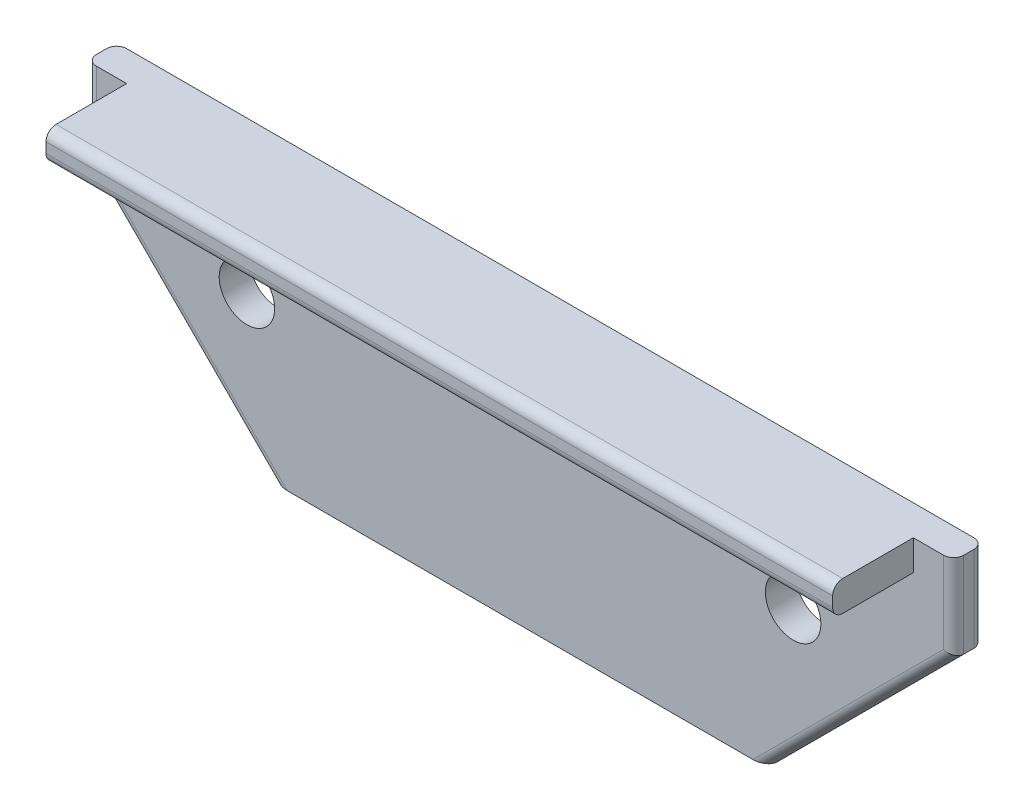
ISO-10303-21;
HEADER;
FILE_DESCRIPTION(('STEP AP214'),'2;1');
FILE_NAME('part.step','',(''),(''),'','','');
FILE_SCHEMA(('AUTOMOTIVE_DESIGN { 1 0 10303 214 1 1 1 1 }'));
ENDSEC;
DATA;
#1=APPLICATION_CONTEXT('core data for automotive mechanical design processes');
#2=APPLICATION_PROTOCOL_DEFINITION('international standard','automotive_design',2000,#1);
#3=PRODUCT_CONTEXT('',#1,'mechanical');
#4=PRODUCT('Part','Part','',(#3));
#5=PRODUCT_RELATED_PRODUCT_CATEGORY('part','',(#4));
#6=PRODUCT_DEFINITION_FORMATION('','',#4);
#7=PRODUCT_DEFINITION_CONTEXT('part definition',#1,'design');
#8=PRODUCT_DEFINITION('design','',#6,#7);
#9=PRODUCT_DEFINITION_SHAPE('','',#8);
#10=(LENGTH_UNIT() NAMED_UNIT(*) SI_UNIT(.MILLI.,.METRE.));
#11=(NAMED_UNIT(*) PLANE_ANGLE_UNIT() SI_UNIT($,.RADIAN.));
#12=(NAMED_UNIT(*) SI_UNIT($,.STERADIAN.) SOLID_ANGLE_UNIT());
#13=UNCERTAINTY_MEASURE_WITH_UNIT(LENGTH_MEASURE(1.E-05),#10,'distance_accuracy_value','');
#14=(GEOMETRIC_REPRESENTATION_CONTEXT(3) GLOBAL_UNCERTAINTY_ASSIGNED_CONTEXT((#13)) GLOBAL_UNIT_ASSIGNED_CONTEXT((#10,
#11,#12)) REPRESENTATION_CONTEXT('',''));
#15=CARTESIAN_POINT('',(0.,0.,0.));
#16=DIRECTION('',(0.,0.,1.));
#17=DIRECTION('',(1.,0.,0.));
#18=AXIS2_PLACEMENT_3D('',#15,#16,#17);
#19=CARTESIAN_POINT('',(0.,0.,-7.9375));
#20=DIRECTION('',(0.,0.,-1.));
#21=DIRECTION('',(-1.,0.,0.));
#22=AXIS2_PLACEMENT_3D('',#19,#20,#21);
#23=PLANE('',#22);
#24=CARTESIAN_POINT('',(85.9789999123034,4.76249999514226,-7.9375));
#25=DIRECTION('',(0.,0.,-1.));
#26=DIRECTION('',(-1.,0.,0.));
#27=AXIS2_PLACEMENT_3D('',#24,#25,#26);
#28=CIRCLE('',#27,8.73124999109411);
#29=CARTESIAN_POINT('',(77.2477499212093,4.76249999514226,-7.9375));
#30=VERTEX_POINT('',#29);
#31=EDGE_CURVE('E232',#30,#30,#28,.T.);
#32=ORIENTED_EDGE('',*,*,#31,.T.);
#33=EDGE_LOOP('',(#32));
#34=FACE_BOUND('',#33,.T.);
#35=CARTESIAN_POINT('',(-85.9789999123005,4.76249999514226,-7.9375));
#36=DIRECTION('',(0.,0.,-1.));
#37=DIRECTION('',(-1.,0.,0.));
#38=AXIS2_PLACEMENT_3D('',#35,#36,#37);
#39=CIRCLE('',#38,8.73124999109411);
#40=CARTESIAN_POINT('',(-94.7102499033946,4.76249999514226,-7.9375));
#41=VERTEX_POINT('',#40);
#42=EDGE_CURVE('E197',#41,#41,#39,.T.);
#43=ORIENTED_EDGE('',*,*,#42,.T.);
#44=EDGE_LOOP('',(#43));
#45=FACE_BOUND('',#44,.T.);
#46=DIRECTION('',(-1.,0.,0.));
#47=VECTOR('',#46,1.);
#48=CARTESIAN_POINT('',(136.524999860745,42.8624999562803,-7.9375));
#49=LINE('',#48,#47);
#50=CARTESIAN_POINT('',(-123.824999873699,42.8624999562803,-7.9375));
#51=VERTEX_POINT('',#50);
#52=CARTESIAN_POINT('',(-133.349999860745,42.8624999562803,-7.9375));
#53=VERTEX_POINT('',#52);
#54=EDGE_CURVE('E188',#51,#53,#49,.T.);
#55=ORIENTED_EDGE('',*,*,#54,.T.);
#56=DIRECTION('',(0.,-1.,0.));
#57=VECTOR('',#56,1.);
#58=CARTESIAN_POINT('',(-133.349999860745,15.8749999838082,-7.9375));
#59=LINE('',#58,#57);
#60=CARTESIAN_POINT('',(-133.349999860745,17.1901280443428,-7.9375));
#61=VERTEX_POINT('',#60);
#62=EDGE_CURVE('E275',#53,#61,#59,.T.);
#63=ORIENTED_EDGE('',*,*,#62,.T.);
#64=DIRECTION('',(0.707106781186556,-0.707106781186539,0.));
#65=VECTOR('',#64,1.);
#66=CARTESIAN_POINT('',(-75.5424358903875,-40.617435926013,-7.9375));
#67=LINE('',#66,#65);
#68=CARTESIAN_POINT('',(-73.2973718601201,-42.8624999562803,-7.9375));
#69=VERTEX_POINT('',#68);
#70=EDGE_CURVE('E273',#61,#69,#67,.T.);
#71=ORIENTED_EDGE('',*,*,#70,.T.);
#72=DIRECTION('',(1.,0.,0.));
#73=VECTOR('',#72,1.);
#74=CARTESIAN_POINT('',(-77.7874999206547,-42.8624999562803,-7.9375));
#75=LINE('',#74,#73);
#76=CARTESIAN_POINT('',(73.2973718601231,-42.8624999562803,-7.9375));
#77=VERTEX_POINT('',#76);
#78=EDGE_CURVE('E187',#69,#77,#75,.T.);
#79=ORIENTED_EDGE('',*,*,#78,.T.);
#80=DIRECTION('',(0.707106781186539,0.707106781186556,0.));
#81=VECTOR('',#80,1.);
#82=CARTESIAN_POINT('',(134.279935830477,18.1200640140755,-7.9375));
#83=LINE('',#82,#81);
#84=CARTESIAN_POINT('',(133.349999860745,17.1901280443428,-7.9375));
#85=VERTEX_POINT('',#84);
#86=EDGE_CURVE('E271',#77,#85,#83,.T.);
#87=ORIENTED_EDGE('',*,*,#86,.T.);
#88=DIRECTION('',(0.,1.,0.));
#89=VECTOR('',#88,1.);
#90=CARTESIAN_POINT('',(133.349999860745,42.8624999562803,-7.9375));
#91=LINE('',#90,#89);
#92=CARTESIAN_POINT('',(133.349999860745,42.8624999562803,-7.9375));
#93=VERTEX_POINT('',#92);
#94=EDGE_CURVE('E186',#85,#93,#91,.T.);
#95=ORIENTED_EDGE('',*,*,#94,.T.);
#96=CARTESIAN_POINT('',(123.824999873699,42.8624999562803,-7.9375));
#97=VERTEX_POINT('',#96);
#98=EDGE_CURVE('E168',#93,#97,#49,.T.);
#99=ORIENTED_EDGE('',*,*,#98,.T.);
#100=DIRECTION('',(0.,1.,0.));
#101=VECTOR('',#100,1.);
#102=CARTESIAN_POINT('',(123.824999873699,42.8624999562803,-7.9375));
#103=LINE('',#102,#101);
#104=CARTESIAN_POINT('',(123.824999873699,33.3374999659958,-7.9375));
#105=VERTEX_POINT('',#104);
#106=EDGE_CURVE('E182',#105,#97,#103,.T.);
#107=ORIENTED_EDGE('',*,*,#106,.F.);
#108=DIRECTION('',(1.,0.,0.));
#109=VECTOR('',#108,1.);
#110=CARTESIAN_POINT('',(123.824999873699,33.3374999659958,-7.9375));
#111=LINE('',#110,#109);
#112=CARTESIAN_POINT('',(-123.824999873699,33.3374999659958,-7.9375));
#113=VERTEX_POINT('',#112);
#114=EDGE_CURVE('E192',#113,#105,#111,.T.);
#115=ORIENTED_EDGE('',*,*,#114,.F.);
#116=DIRECTION('',(0.,-1.,0.));
#117=VECTOR('',#116,1.);
#118=CARTESIAN_POINT('',(-123.824999873699,33.3374999659958,-7.9375));
#119=LINE('',#118,#117);
#120=EDGE_CURVE('E191',#51,#113,#119,.T.);
#121=ORIENTED_EDGE('',*,*,#120,.F.);
#122=EDGE_LOOP('',(#55,#63,#71,#79,#87,#95,#99,#107,#115,#121));
#123=FACE_BOUND('',#122,.T.);
#124=ADVANCED_FACE('F39',(#34,#45,#123),#23,.F.);
#125=CARTESIAN_POINT('',(77.7874999206576,-42.8624999562803,-17.4625));
#126=DIRECTION('',(0.707106781186556,-0.707106781186539,0.));
#127=DIRECTION('',(0.707106781186539,0.707106781186556,0.));
#128=AXIS2_PLACEMENT_3D('',#125,#126,#127);
#129=PLANE('',#128);
#130=DIRECTION('',(0.,0.,1.));
#131=VECTOR('',#130,1.);
#132=CARTESIAN_POINT('',(77.7874999206576,-42.8624999562803,-17.4625));
#133=LINE('',#132,#131);
#134=CARTESIAN_POINT('',(77.7874999206576,-42.8624999562803,-14.2875));
#135=VERTEX_POINT('',#134);
#136=CARTESIAN_POINT('',(77.7874999206576,-42.8624999562803,-11.1125));
#137=VERTEX_POINT('',#136);
#138=EDGE_CURVE('E214',#135,#137,#133,.T.);
#139=ORIENTED_EDGE('',*,*,#138,.F.);
#140=DIRECTION('',(0.707106781186539,0.707106781186556,0.));
#141=VECTOR('',#140,1.);
#142=CARTESIAN_POINT('',(77.7874999206576,-42.8624999562803,-14.2875));
#143=LINE('',#142,#141);
#144=CARTESIAN_POINT('',(136.524999860745,15.8749999838083,-14.2875));
#145=VERTEX_POINT('',#144);
#146=EDGE_CURVE('E285',#135,#145,#143,.T.);
#147=ORIENTED_EDGE('',*,*,#146,.T.);
#148=DIRECTION('',(0.,0.,1.));
#149=VECTOR('',#148,1.);
#150=CARTESIAN_POINT('',(136.524999860745,15.8749999838083,-17.4625));
#151=LINE('',#150,#149);
#152=CARTESIAN_POINT('',(136.524999860745,15.8749999838083,-11.1125));
#153=VERTEX_POINT('',#152);
#154=EDGE_CURVE('E210',#145,#153,#151,.T.);
#155=ORIENTED_EDGE('',*,*,#154,.T.);
#156=DIRECTION('',(0.707106781186539,0.707106781186556,0.));
#157=VECTOR('',#156,1.);
#158=CARTESIAN_POINT('',(77.7874999206576,-42.8624999562803,-11.1125));
#159=LINE('',#158,#157);
#160=EDGE_CURVE('E283',#153,#137,#159,.F.);
#161=ORIENTED_EDGE('',*,*,#160,.T.);
#162=EDGE_LOOP('',(#139,#147,#155,#161));
#163=FACE_BOUND('',#162,.T.);
#164=ADVANCED_FACE('F396',(#163),#129,.T.);
#165=CARTESIAN_POINT('',(-77.7874999206547,-42.8624999562803,-17.4625));
#166=DIRECTION('',(0.,-1.,0.));
#167=DIRECTION('',(0.,0.,-1.));
#168=AXIS2_PLACEMENT_3D('',#165,#166,#167);
#169=PLANE('',#168);
#170=DIRECTION('',(0.,0.,1.));
#171=VECTOR('',#170,1.);
#172=CARTESIAN_POINT('',(-77.7874999206547,-42.8624999562803,-17.4625));
#173=LINE('',#172,#171);
#174=CARTESIAN_POINT('',(-77.7874999206547,-42.8624999562803,-14.2875));
#175=VERTEX_POINT('',#174);
#176=CARTESIAN_POINT('',(-77.7874999206547,-42.8624999562803,-11.1125));
#177=VERTEX_POINT('',#176);
#178=EDGE_CURVE('E218',#175,#177,#173,.T.);
#179=ORIENTED_EDGE('',*,*,#178,.F.);
#180=CARTESIAN_POINT('',(-73.2973718601201,-42.8624999562803,-14.2875));
#181=DIRECTION('',(0.,-1.,0.));
#182=DIRECTION('',(1.,0.,0.));
#183=AXIS2_PLACEMENT_3D('',#180,#181,#182);
#184=ELLIPSE('',#183,4.49012806053463,3.175);
#185=CARTESIAN_POINT('',(-73.2973718601201,-42.8624999562803,-17.4625));
#186=VERTEX_POINT('',#185);
#187=EDGE_CURVE('E247',#175,#186,#184,.T.);
#188=ORIENTED_EDGE('',*,*,#187,.T.);
#189=DIRECTION('',(1.,0.,0.));
#190=VECTOR('',#189,1.);
#191=CARTESIAN_POINT('',(-77.7874999206547,-42.8624999562803,-17.4625));
#192=LINE('',#191,#190);
#193=CARTESIAN_POINT('',(73.2973718601231,-42.8624999562803,-17.4625));
#194=VERTEX_POINT('',#193);
#195=EDGE_CURVE('E208',#186,#194,#192,.T.);
#196=ORIENTED_EDGE('',*,*,#195,.T.);
#197=CARTESIAN_POINT('',(73.2973718601231,-42.8624999562803,-14.2875));
#198=DIRECTION('',(0.,-1.,0.));
#199=DIRECTION('',(1.,0.,0.));
#200=AXIS2_PLACEMENT_3D('',#197,#198,#199);
#201=ELLIPSE('',#200,4.49012806053452,3.175);
#202=EDGE_CURVE('E243',#194,#135,#201,.T.);
#203=ORIENTED_EDGE('',*,*,#202,.T.);
#204=ORIENTED_EDGE('',*,*,#138,.T.);
#205=CARTESIAN_POINT('',(73.2973718601231,-42.8624999562803,-11.1125));
#206=DIRECTION('',(0.,-1.,0.));
#207=DIRECTION('',(-1.,0.,0.));
#208=AXIS2_PLACEMENT_3D('',#205,#206,#207);
#209=ELLIPSE('',#208,4.49012806053452,3.175);
#210=EDGE_CURVE('E241',#137,#77,#209,.T.);
#211=ORIENTED_EDGE('',*,*,#210,.T.);
#212=ORIENTED_EDGE('',*,*,#78,.F.);
#213=CARTESIAN_POINT('',(-73.2973718601201,-42.8624999562803,-11.1125));
#214=DIRECTION('',(0.,-1.,0.));
#215=DIRECTION('',(-1.,0.,0.));
#216=AXIS2_PLACEMENT_3D('',#213,#214,#215);
#217=ELLIPSE('',#216,4.49012806053463,3.175);
#218=EDGE_CURVE('E245',#69,#177,#217,.T.);
#219=ORIENTED_EDGE('',*,*,#218,.T.);
#220=EDGE_LOOP('',(#179,#188,#196,#203,#204,#211,#212,#219));
#221=FACE_BOUND('',#220,.T.);
#222=ADVANCED_FACE('F323',(#221),#169,.T.);
#223=CARTESIAN_POINT('',(-136.524999860745,15.8749999838082,-17.4625));
#224=DIRECTION('',(-0.707106781186539,-0.707106781186556,0.));
#225=DIRECTION('',(0.707106781186556,-0.707106781186539,0.));
#226=AXIS2_PLACEMENT_3D('',#223,#224,#225);
#227=PLANE('',#226);
#228=DIRECTION('',(0.,0.,1.));
#229=VECTOR('',#228,1.);
#230=CARTESIAN_POINT('',(-136.524999860745,15.8749999838082,-17.4625));
#231=LINE('',#230,#229);
#232=CARTESIAN_POINT('',(-136.524999860745,15.8749999838082,-14.2875));
#233=VERTEX_POINT('',#232);
#234=CARTESIAN_POINT('',(-136.524999860745,15.8749999838082,-11.1125));
#235=VERTEX_POINT('',#234);
#236=EDGE_CURVE('E221',#233,#235,#231,.T.);
#237=ORIENTED_EDGE('',*,*,#236,.F.);
#238=DIRECTION('',(0.707106781186556,-0.707106781186539,0.));
#239=VECTOR('',#238,1.);
#240=CARTESIAN_POINT('',(-136.524999860745,15.8749999838082,-14.2875));
#241=LINE('',#240,#239);
#242=EDGE_CURVE('E238',#233,#175,#241,.T.);
#243=ORIENTED_EDGE('',*,*,#242,.T.);
#244=ORIENTED_EDGE('',*,*,#178,.T.);
#245=DIRECTION('',(0.707106781186556,-0.707106781186539,0.));
#246=VECTOR('',#245,1.);
#247=CARTESIAN_POINT('',(-136.524999860745,15.8749999838082,-11.1125));
#248=LINE('',#247,#246);
#249=EDGE_CURVE('E217',#177,#235,#248,.F.);
#250=ORIENTED_EDGE('',*,*,#249,.T.);
#251=EDGE_LOOP('',(#237,#243,#244,#250));
#252=FACE_BOUND('',#251,.T.);
#253=ADVANCED_FACE('F330',(#252),#227,.T.);
#254=CARTESIAN_POINT('',(-136.524999860745,42.8624999562803,-17.4625));
#255=DIRECTION('',(-1.,0.,0.));
#256=DIRECTION('',(0.,0.,1.));
#257=AXIS2_PLACEMENT_3D('',#254,#255,#256);
#258=PLANE('',#257);
#259=DIRECTION('',(0.,0.,1.));
#260=VECTOR('',#259,1.);
#261=CARTESIAN_POINT('',(-136.524999860745,42.8624999562803,-17.4625));
#262=LINE('',#261,#260);
#263=CARTESIAN_POINT('',(-136.524999860745,42.8624999562803,-14.2875));
#264=VERTEX_POINT('',#263);
#265=CARTESIAN_POINT('',(-136.524999860745,42.8624999562803,-11.1125));
#266=VERTEX_POINT('',#265);
#267=EDGE_CURVE('E224',#264,#266,#262,.T.);
#268=ORIENTED_EDGE('',*,*,#267,.F.);
#269=DIRECTION('',(0.,-1.,0.));
#270=VECTOR('',#269,1.);
#271=CARTESIAN_POINT('',(-136.524999860745,42.8624999562803,-14.2875));
#272=LINE('',#271,#270);
#273=EDGE_CURVE('E259',#264,#233,#272,.T.);
#274=ORIENTED_EDGE('',*,*,#273,.T.);
#275=ORIENTED_EDGE('',*,*,#236,.T.);
#276=DIRECTION('',(0.,-1.,0.));
#277=VECTOR('',#276,1.);
#278=CARTESIAN_POINT('',(-136.524999860745,42.8624999562803,-11.1125));
#279=LINE('',#278,#277);
#280=EDGE_CURVE('E257',#235,#266,#279,.F.);
#281=ORIENTED_EDGE('',*,*,#280,.T.);
#282=EDGE_LOOP('',(#268,#274,#275,#281));
#283=FACE_BOUND('',#282,.T.);
#284=ADVANCED_FACE('F335',(#283),#258,.T.);
#285=CARTESIAN_POINT('',(136.524999860745,42.8624999562803,-17.4625));
#286=DIRECTION('',(0.,1.,0.));
#287=DIRECTION('',(0.,0.,1.));
#288=AXIS2_PLACEMENT_3D('',#285,#286,#287);
#289=PLANE('',#288);
#290=DIRECTION('',(-1.,0.,0.));
#291=VECTOR('',#290,1.);
#292=CARTESIAN_POINT('',(136.524999860745,42.8624999562803,-17.4625));
#293=LINE('',#292,#291);
#294=CARTESIAN_POINT('',(133.349999860745,42.8624999562803,-17.4625));
#295=VERTEX_POINT('',#294);
#296=CARTESIAN_POINT('',(-133.349999860745,42.8624999562803,-17.4625));
#297=VERTEX_POINT('',#296);
#298=EDGE_CURVE('E206',#295,#297,#293,.T.);
#299=ORIENTED_EDGE('',*,*,#298,.T.);
#300=CARTESIAN_POINT('',(-133.349999860745,42.8624999562803,-14.2875));
#301=DIRECTION('',(0.,1.,0.));
#302=DIRECTION('',(0.,0.,1.));
#303=AXIS2_PLACEMENT_3D('',#300,#301,#302);
#304=CIRCLE('',#303,3.175);
#305=EDGE_CURVE('E268',#297,#264,#304,.T.);
#306=ORIENTED_EDGE('',*,*,#305,.T.);
#307=ORIENTED_EDGE('',*,*,#267,.T.);
#308=CARTESIAN_POINT('',(-133.349999860745,42.8624999562803,-11.1125));
#309=DIRECTION('',(0.,1.,0.));
#310=DIRECTION('',(0.,0.,1.));
#311=AXIS2_PLACEMENT_3D('',#308,#309,#310);
#312=CIRCLE('',#311,3.175);
#313=EDGE_CURVE('E266',#266,#53,#312,.T.);
#314=ORIENTED_EDGE('',*,*,#313,.T.);
#315=ORIENTED_EDGE('',*,*,#54,.F.);
#316=DIRECTION('',(0.,0.,-1.));
#317=VECTOR('',#316,1.);
#318=CARTESIAN_POINT('',(-123.824999873699,42.8624999562803,17.4625));
#319=LINE('',#318,#317);
#320=CARTESIAN_POINT('',(-123.824999873699,42.8624999562803,14.2875));
#321=VERTEX_POINT('',#320);
#322=EDGE_CURVE('E176',#321,#51,#319,.T.);
#323=ORIENTED_EDGE('',*,*,#322,.F.);
#324=DIRECTION('',(-1.,0.,0.));
#325=VECTOR('',#324,1.);
#326=CARTESIAN_POINT('',(123.824999873699,42.8624999562803,14.2875));
#327=LINE('',#326,#325);
#328=CARTESIAN_POINT('',(123.824999873699,42.8624999562803,14.2875));
#329=VERTEX_POINT('',#328);
#330=EDGE_CURVE('E172',#321,#329,#327,.F.);
#331=ORIENTED_EDGE('',*,*,#330,.T.);
#332=DIRECTION('',(0.,0.,-1.));
#333=VECTOR('',#332,1.);
#334=CARTESIAN_POINT('',(123.824999873699,42.8624999562803,17.4625));
#335=LINE('',#334,#333);
#336=EDGE_CURVE('E164',#329,#97,#335,.T.);
#337=ORIENTED_EDGE('',*,*,#336,.T.);
#338=ORIENTED_EDGE('',*,*,#98,.F.);
#339=CARTESIAN_POINT('',(133.349999860745,42.8624999562803,-11.1125));
#340=DIRECTION('',(0.,1.,0.));
#341=DIRECTION('',(0.,0.,1.));
#342=AXIS2_PLACEMENT_3D('',#339,#340,#341);
#343=CIRCLE('',#342,3.175);
#344=CARTESIAN_POINT('',(136.524999860745,42.8624999562803,-11.1125));
#345=VERTEX_POINT('',#344);
#346=EDGE_CURVE('E261',#93,#345,#343,.T.);
#347=ORIENTED_EDGE('',*,*,#346,.T.);
#348=DIRECTION('',(0.,0.,1.));
#349=VECTOR('',#348,1.);
#350=CARTESIAN_POINT('',(136.524999860745,42.8624999562803,-17.4625));
#351=LINE('',#350,#349);
#352=CARTESIAN_POINT('',(136.524999860745,42.8624999562803,-14.2875));
#353=VERTEX_POINT('',#352);
#354=EDGE_CURVE('E227',#353,#345,#351,.T.);
#355=ORIENTED_EDGE('',*,*,#354,.F.);
#356=CARTESIAN_POINT('',(133.349999860745,42.8624999562803,-14.2875));
#357=DIRECTION('',(0.,1.,0.));
#358=DIRECTION('',(0.,0.,1.));
#359=AXIS2_PLACEMENT_3D('',#356,#357,#358);
#360=CIRCLE('',#359,3.175);
#361=EDGE_CURVE('E264',#353,#295,#360,.T.);
#362=ORIENTED_EDGE('',*,*,#361,.T.);
#363=EDGE_LOOP('',(#299,#306,#307,#314,#315,#323,#331,#337,#338,#347,#355,#362));
#364=FACE_BOUND('',#363,.T.);
#365=ADVANCED_FACE('F167',(#364),#289,.T.);
#366=CARTESIAN_POINT('',(136.524999860745,15.8749999838083,-17.4625));
#367=DIRECTION('',(1.,0.,0.));
#368=DIRECTION('',(0.,0.,-1.));
#369=AXIS2_PLACEMENT_3D('',#366,#367,#368);
#370=PLANE('',#369);
#371=ORIENTED_EDGE('',*,*,#154,.F.);
#372=DIRECTION('',(0.,1.,0.));
#373=VECTOR('',#372,1.);
#374=CARTESIAN_POINT('',(136.524999860745,15.8749999838083,-14.2875));
#375=LINE('',#374,#373);
#376=EDGE_CURVE('E280',#145,#353,#375,.T.);
#377=ORIENTED_EDGE('',*,*,#376,.T.);
#378=ORIENTED_EDGE('',*,*,#354,.T.);
#379=DIRECTION('',(0.,1.,0.));
#380=VECTOR('',#379,1.);
#381=CARTESIAN_POINT('',(136.524999860745,15.8749999838083,-11.1125));
#382=LINE('',#381,#380);
#383=EDGE_CURVE('E278',#345,#153,#382,.F.);
#384=ORIENTED_EDGE('',*,*,#383,.T.);
#385=EDGE_LOOP('',(#371,#377,#378,#384));
#386=FACE_BOUND('',#385,.T.);
#387=ADVANCED_FACE('F371',(#386),#370,.T.);
#388=CARTESIAN_POINT('',(0.,0.,-17.4625));
#389=DIRECTION('',(0.,0.,-1.));
#390=DIRECTION('',(-1.,0.,0.));
#391=AXIS2_PLACEMENT_3D('',#388,#389,#390);
#392=PLANE('',#391);
#393=CARTESIAN_POINT('',(85.9789999123034,4.76249999514226,-17.4625));
#394=DIRECTION('',(0.,0.,-1.));
#395=DIRECTION('',(-1.,0.,0.));
#396=AXIS2_PLACEMENT_3D('',#393,#394,#395);
#397=CIRCLE('',#396,8.73124999109411);
#398=CARTESIAN_POINT('',(77.2477499212093,4.76249999514226,-17.4625));
#399=VERTEX_POINT('',#398);
#400=EDGE_CURVE('E236',#399,#399,#397,.T.);
#401=ORIENTED_EDGE('',*,*,#400,.F.);
#402=EDGE_LOOP('',(#401));
#403=FACE_BOUND('',#402,.T.);
#404=CARTESIAN_POINT('',(-85.9789999123005,4.76249999514226,-17.4625));
#405=DIRECTION('',(0.,0.,-1.));
#406=DIRECTION('',(-1.,0.,0.));
#407=AXIS2_PLACEMENT_3D('',#404,#405,#406);
#408=CIRCLE('',#407,8.73124999109411);
#409=CARTESIAN_POINT('',(-94.7102499033946,4.76249999514226,-17.4625));
#410=VERTEX_POINT('',#409);
#411=EDGE_CURVE('E235',#410,#410,#408,.T.);
#412=ORIENTED_EDGE('',*,*,#411,.F.);
#413=EDGE_LOOP('',(#412));
#414=FACE_BOUND('',#413,.T.);
#415=ORIENTED_EDGE('',*,*,#195,.F.);
#416=DIRECTION('',(0.707106781186556,-0.707106781186539,0.));
#417=VECTOR('',#416,1.);
#418=CARTESIAN_POINT('',(-58.0799359081993,-58.0799359082007,-17.4625));
#419=LINE('',#418,#417);
#420=CARTESIAN_POINT('',(-133.349999860745,17.1901280443428,-17.4625));
#421=VERTEX_POINT('',#420);
#422=EDGE_CURVE('E255',#186,#421,#419,.F.);
#423=ORIENTED_EDGE('',*,*,#422,.T.);
#424=DIRECTION('',(0.,-1.,0.));
#425=VECTOR('',#424,1.);
#426=CARTESIAN_POINT('',(-133.349999860745,0.,-17.4625));
#427=LINE('',#426,#425);
#428=EDGE_CURVE('E253',#421,#297,#427,.F.);
#429=ORIENTED_EDGE('',*,*,#428,.T.);
#430=ORIENTED_EDGE('',*,*,#298,.F.);
#431=DIRECTION('',(0.,1.,0.));
#432=VECTOR('',#431,1.);
#433=CARTESIAN_POINT('',(133.349999860745,0.,-17.4625));
#434=LINE('',#433,#432);
#435=CARTESIAN_POINT('',(133.349999860745,17.1901280443428,-17.4625));
#436=VERTEX_POINT('',#435);
#437=EDGE_CURVE('E251',#295,#436,#434,.F.);
#438=ORIENTED_EDGE('',*,*,#437,.T.);
#439=DIRECTION('',(0.707106781186539,0.707106781186556,0.));
#440=VECTOR('',#439,1.);
#441=CARTESIAN_POINT('',(58.0799359082026,-58.0799359082012,-17.4625));
#442=LINE('',#441,#440);
#443=EDGE_CURVE('E249',#436,#194,#442,.F.);
#444=ORIENTED_EDGE('',*,*,#443,.T.);
#445=EDGE_LOOP('',(#415,#423,#429,#430,#438,#444));
#446=FACE_BOUND('',#445,.T.);
#447=ADVANCED_FACE('F367',(#403,#414,#446),#392,.T.);
#448=CARTESIAN_POINT('',(123.824999873699,33.3374999659958,17.4625));
#449=DIRECTION('',(0.,1.,0.));
#450=DIRECTION('',(0.,0.,1.));
#451=AXIS2_PLACEMENT_3D('',#448,#449,#450);
#452=PLANE('',#451);
#453=DIRECTION('',(0.,0.,-1.));
#454=VECTOR('',#453,1.);
#455=CARTESIAN_POINT('',(123.824999873699,33.3374999659958,17.4625));
#456=LINE('',#455,#454);
#457=CARTESIAN_POINT('',(123.824999873699,33.3374999659958,14.2875));
#458=VERTEX_POINT('',#457);
#459=EDGE_CURVE('E175',#458,#105,#456,.T.);
#460=ORIENTED_EDGE('',*,*,#459,.F.);
#461=DIRECTION('',(1.,0.,0.));
#462=VECTOR('',#461,1.);
#463=CARTESIAN_POINT('',(123.824999873699,33.3374999659958,14.2875));
#464=LINE('',#463,#462);
#465=CARTESIAN_POINT('',(-123.824999873699,33.3374999659958,14.2875));
#466=VERTEX_POINT('',#465);
#467=EDGE_CURVE('E11',#458,#466,#464,.F.);
#468=ORIENTED_EDGE('',*,*,#467,.T.);
#469=DIRECTION('',(0.,0.,-1.));
#470=VECTOR('',#469,1.);
#471=CARTESIAN_POINT('',(-123.824999873699,33.3374999659958,17.4625));
#472=LINE('',#471,#470);
#473=EDGE_CURVE('E201',#466,#113,#472,.T.);
#474=ORIENTED_EDGE('',*,*,#473,.T.);
#475=ORIENTED_EDGE('',*,*,#114,.T.);
#476=EDGE_LOOP('',(#460,#468,#474,#475));
#477=FACE_BOUND('',#476,.T.);
#478=ADVANCED_FACE('F370',(#477),#452,.F.);
#479=CARTESIAN_POINT('',(123.824999873699,42.8624999562803,17.4625));
#480=DIRECTION('',(-1.,0.,0.));
#481=DIRECTION('',(0.,0.,1.));
#482=AXIS2_PLACEMENT_3D('',#479,#480,#481);
#483=PLANE('',#482);
#484=ORIENTED_EDGE('',*,*,#336,.F.);
#485=CARTESIAN_POINT('',(123.824999873699,39.6874999562803,14.2875));
#486=DIRECTION('',(-1.,0.,0.));
#487=DIRECTION('',(0.,0.,1.));
#488=AXIS2_PLACEMENT_3D('',#485,#486,#487);
#489=CIRCLE('',#488,3.175);
#490=CARTESIAN_POINT('',(123.824999873699,39.6874999562803,17.4625));
#491=VERTEX_POINT('',#490);
#492=EDGE_CURVE('E48',#329,#491,#489,.F.);
#493=ORIENTED_EDGE('',*,*,#492,.T.);
#494=DIRECTION('',(0.,1.,0.));
#495=VECTOR('',#494,1.);
#496=CARTESIAN_POINT('',(123.824999873699,42.8624999562803,17.4625));
#497=LINE('',#496,#495);
#498=CARTESIAN_POINT('',(123.824999873699,36.5124999659958,17.4625));
#499=VERTEX_POINT('',#498);
#500=EDGE_CURVE('E195',#499,#491,#497,.T.);
#501=ORIENTED_EDGE('',*,*,#500,.F.);
#502=CARTESIAN_POINT('',(123.824999873699,36.5124999659958,14.2875));
#503=DIRECTION('',(-1.,0.,0.));
#504=DIRECTION('',(0.,0.,1.));
#505=AXIS2_PLACEMENT_3D('',#502,#503,#504);
#506=CIRCLE('',#505,3.175);
#507=EDGE_CURVE('E56',#499,#458,#506,.F.);
#508=ORIENTED_EDGE('',*,*,#507,.T.);
#509=ORIENTED_EDGE('',*,*,#459,.T.);
#510=ORIENTED_EDGE('',*,*,#106,.T.);
#511=EDGE_LOOP('',(#484,#493,#501,#508,#509,#510));
#512=FACE_BOUND('',#511,.T.);
#513=ADVANCED_FACE('F190',(#512),#483,.F.);
#514=CARTESIAN_POINT('',(-123.824999873699,33.3374999659958,17.4625));
#515=DIRECTION('',(1.,0.,0.));
#516=DIRECTION('',(0.,0.,-1.));
#517=AXIS2_PLACEMENT_3D('',#514,#515,#516);
#518=PLANE('',#517);
#519=DIRECTION('',(0.,-1.,0.));
#520=VECTOR('',#519,1.);
#521=CARTESIAN_POINT('',(-123.824999873699,33.3374999659958,17.4625));
#522=LINE('',#521,#520);
#523=CARTESIAN_POINT('',(-123.824999873699,39.6874999562803,17.4625));
#524=VERTEX_POINT('',#523);
#525=CARTESIAN_POINT('',(-123.824999873699,36.5124999659958,17.4625));
#526=VERTEX_POINT('',#525);
#527=EDGE_CURVE('E203',#524,#526,#522,.T.);
#528=ORIENTED_EDGE('',*,*,#527,.F.);
#529=CARTESIAN_POINT('',(-123.824999873699,39.6874999562803,14.2875));
#530=DIRECTION('',(1.,0.,0.));
#531=DIRECTION('',(0.,0.,-1.));
#532=AXIS2_PLACEMENT_3D('',#529,#530,#531);
#533=CIRCLE('',#532,3.175);
#534=EDGE_CURVE('E295',#524,#321,#533,.F.);
#535=ORIENTED_EDGE('',*,*,#534,.T.);
#536=ORIENTED_EDGE('',*,*,#322,.T.);
#537=ORIENTED_EDGE('',*,*,#120,.T.);
#538=ORIENTED_EDGE('',*,*,#473,.F.);
#539=CARTESIAN_POINT('',(-123.824999873699,36.5124999659958,14.2875));
#540=DIRECTION('',(1.,0.,0.));
#541=DIRECTION('',(0.,0.,-1.));
#542=AXIS2_PLACEMENT_3D('',#539,#540,#541);
#543=CIRCLE('',#542,3.175);
#544=EDGE_CURVE('E293',#466,#526,#543,.F.);
#545=ORIENTED_EDGE('',*,*,#544,.T.);
#546=EDGE_LOOP('',(#528,#535,#536,#537,#538,#545));
#547=FACE_BOUND('',#546,.T.);
#548=ADVANCED_FACE('F345',(#547),#518,.F.);
#549=CARTESIAN_POINT('',(0.,0.,17.4625));
#550=DIRECTION('',(0.,0.,-1.));
#551=DIRECTION('',(-1.,0.,0.));
#552=AXIS2_PLACEMENT_3D('',#549,#550,#551);
#553=PLANE('',#552);
#554=ORIENTED_EDGE('',*,*,#500,.T.);
#555=DIRECTION('',(-1.,0.,0.));
#556=VECTOR('',#555,1.);
#557=CARTESIAN_POINT('',(-123.824999873699,39.6874999562803,17.4625));
#558=LINE('',#557,#556);
#559=EDGE_CURVE('E290',#491,#524,#558,.T.);
#560=ORIENTED_EDGE('',*,*,#559,.T.);
#561=ORIENTED_EDGE('',*,*,#527,.T.);
#562=DIRECTION('',(1.,0.,0.));
#563=VECTOR('',#562,1.);
#564=CARTESIAN_POINT('',(0.,36.5124999659958,17.4625));
#565=LINE('',#564,#563);
#566=EDGE_CURVE('E287',#526,#499,#565,.T.);
#567=ORIENTED_EDGE('',*,*,#566,.T.);
#568=EDGE_LOOP('',(#554,#560,#561,#567));
#569=FACE_BOUND('',#568,.T.);
#570=ADVANCED_FACE('F352',(#569),#553,.F.);
#571=CARTESIAN_POINT('',(-85.9789999123005,4.76249999514226,-17.4625));
#572=DIRECTION('',(0.,0.,-1.));
#573=DIRECTION('',(-1.,0.,0.));
#574=AXIS2_PLACEMENT_3D('',#571,#572,#573);
#575=CYLINDRICAL_SURFACE('',#574,8.73124999109411);
#576=ORIENTED_EDGE('',*,*,#411,.T.);
#577=EDGE_LOOP('',(#576));
#578=FACE_BOUND('',#577,.T.);
#579=ORIENTED_EDGE('',*,*,#42,.F.);
#580=EDGE_LOOP('',(#579));
#581=FACE_BOUND('',#580,.T.);
#582=ADVANCED_FACE('F472',(#578,#581),#575,.F.);
#583=CARTESIAN_POINT('',(85.9789999123034,4.76249999514226,-17.4625));
#584=DIRECTION('',(0.,0.,-1.));
#585=DIRECTION('',(-1.,0.,0.));
#586=AXIS2_PLACEMENT_3D('',#583,#584,#585);
#587=CYLINDRICAL_SURFACE('',#586,8.73124999109411);
#588=ORIENTED_EDGE('',*,*,#400,.T.);
#589=EDGE_LOOP('',(#588));
#590=FACE_BOUND('',#589,.T.);
#591=ORIENTED_EDGE('',*,*,#31,.F.);
#592=EDGE_LOOP('',(#591));
#593=FACE_BOUND('',#592,.T.);
#594=ADVANCED_FACE('F364',(#590,#593),#587,.F.);
#595=CARTESIAN_POINT('',(-133.349999860745,42.8624999562803,-14.2875));
#596=DIRECTION('',(0.,-1.,0.));
#597=DIRECTION('',(0.,0.,-1.));
#598=AXIS2_PLACEMENT_3D('',#595,#596,#597);
#599=CYLINDRICAL_SURFACE('',#598,3.175);
#600=ORIENTED_EDGE('',*,*,#305,.F.);
#601=ORIENTED_EDGE('',*,*,#428,.F.);
#602=CARTESIAN_POINT('',(-133.349999860745,17.1901280443428,-14.2875));
#603=DIRECTION('',(0.382683432365096,-0.923879532511284,0.));
#604=DIRECTION('',(-0.923879532511284,-0.382683432365096,0.));
#605=AXIS2_PLACEMENT_3D('',#602,#603,#604);
#606=ELLIPSE('',#605,3.43659523592836,3.175);
#607=EDGE_CURVE('E299',#233,#421,#606,.T.);
#608=ORIENTED_EDGE('',*,*,#607,.F.);
#609=ORIENTED_EDGE('',*,*,#273,.F.);
#610=EDGE_LOOP('',(#600,#601,#608,#609));
#611=FACE_BOUND('',#610,.T.);
#612=ADVANCED_FACE('F385',(#611),#599,.T.);
#613=CARTESIAN_POINT('',(-134.279935830477,18.1200640140756,-14.2875));
#614=DIRECTION('',(0.707106781186556,-0.707106781186539,0.));
#615=DIRECTION('',(0.707106781186539,0.707106781186556,0.));
#616=AXIS2_PLACEMENT_3D('',#613,#614,#615);
#617=CYLINDRICAL_SURFACE('',#616,3.175);
#618=ORIENTED_EDGE('',*,*,#607,.T.);
#619=ORIENTED_EDGE('',*,*,#422,.F.);
#620=ORIENTED_EDGE('',*,*,#187,.F.);
#621=ORIENTED_EDGE('',*,*,#242,.F.);
#622=EDGE_LOOP('',(#618,#619,#620,#621));
#623=FACE_BOUND('',#622,.T.);
#624=ADVANCED_FACE('F381',(#623),#617,.T.);
#625=CARTESIAN_POINT('',(-58.0799359081993,-58.0799359082007,-11.1125));
#626=DIRECTION('',(-0.707106781186556,0.707106781186539,0.));
#627=DIRECTION('',(-0.707106781186539,-0.707106781186556,0.));
#628=AXIS2_PLACEMENT_3D('',#625,#626,#627);
#629=CYLINDRICAL_SURFACE('',#628,3.175);
#630=ORIENTED_EDGE('',*,*,#218,.F.);
#631=ORIENTED_EDGE('',*,*,#70,.F.);
#632=CARTESIAN_POINT('',(-133.349999860745,17.1901280443428,-11.1125));
#633=DIRECTION('',(-0.382683432365096,0.923879532511284,0.));
#634=DIRECTION('',(-0.923879532511284,-0.382683432365096,0.));
#635=AXIS2_PLACEMENT_3D('',#632,#633,#634);
#636=ELLIPSE('',#635,3.43659523592836,3.175);
#637=EDGE_CURVE('E302',#235,#61,#636,.T.);
#638=ORIENTED_EDGE('',*,*,#637,.F.);
#639=ORIENTED_EDGE('',*,*,#249,.F.);
#640=EDGE_LOOP('',(#630,#631,#638,#639));
#641=FACE_BOUND('',#640,.T.);
#642=ADVANCED_FACE('F326',(#641),#629,.T.);
#643=CARTESIAN_POINT('',(-133.349999860745,0.,-11.1125));
#644=DIRECTION('',(0.,1.,0.));
#645=DIRECTION('',(0.,0.,1.));
#646=AXIS2_PLACEMENT_3D('',#643,#644,#645);
#647=CYLINDRICAL_SURFACE('',#646,3.175);
#648=ORIENTED_EDGE('',*,*,#313,.F.);
#649=ORIENTED_EDGE('',*,*,#280,.F.);
#650=ORIENTED_EDGE('',*,*,#637,.T.);
#651=ORIENTED_EDGE('',*,*,#62,.F.);
#652=EDGE_LOOP('',(#648,#649,#650,#651));
#653=FACE_BOUND('',#652,.T.);
#654=ADVANCED_FACE('F339',(#653),#647,.T.);
#655=CARTESIAN_POINT('',(75.5424358903903,-40.6174359260131,-14.2875));
#656=DIRECTION('',(0.707106781186539,0.707106781186556,0.));
#657=DIRECTION('',(-0.707106781186556,0.707106781186539,0.));
#658=AXIS2_PLACEMENT_3D('',#655,#656,#657);
#659=CYLINDRICAL_SURFACE('',#658,3.175);
#660=ORIENTED_EDGE('',*,*,#202,.F.);
#661=ORIENTED_EDGE('',*,*,#443,.F.);
#662=CARTESIAN_POINT('',(133.349999860745,17.1901280443428,-14.2875));
#663=DIRECTION('',(0.382683432365084,0.923879532511289,0.));
#664=DIRECTION('',(0.923879532511289,-0.382683432365084,0.));
#665=AXIS2_PLACEMENT_3D('',#662,#663,#664);
#666=ELLIPSE('',#665,3.43659523592834,3.175);
#667=EDGE_CURVE('E303',#145,#436,#666,.T.);
#668=ORIENTED_EDGE('',*,*,#667,.F.);
#669=ORIENTED_EDGE('',*,*,#146,.F.);
#670=EDGE_LOOP('',(#660,#661,#668,#669));
#671=FACE_BOUND('',#670,.T.);
#672=ADVANCED_FACE('F394',(#671),#659,.T.);
#673=CARTESIAN_POINT('',(133.349999860745,15.8749999838083,-14.2875));
#674=DIRECTION('',(0.,1.,0.));
#675=DIRECTION('',(0.,0.,1.));
#676=AXIS2_PLACEMENT_3D('',#673,#674,#675);
#677=CYLINDRICAL_SURFACE('',#676,3.175);
#678=ORIENTED_EDGE('',*,*,#667,.T.);
#679=ORIENTED_EDGE('',*,*,#437,.F.);
#680=ORIENTED_EDGE('',*,*,#361,.F.);
#681=ORIENTED_EDGE('',*,*,#376,.F.);
#682=EDGE_LOOP('',(#678,#679,#680,#681));
#683=FACE_BOUND('',#682,.T.);
#684=ADVANCED_FACE('F388',(#683),#677,.T.);
#685=CARTESIAN_POINT('',(0.,39.6874999562803,14.2875));
#686=DIRECTION('',(1.,0.,0.));
#687=DIRECTION('',(0.,0.,-1.));
#688=AXIS2_PLACEMENT_3D('',#685,#686,#687);
#689=CYLINDRICAL_SURFACE('',#688,3.175);
#690=ORIENTED_EDGE('',*,*,#492,.F.);
#691=ORIENTED_EDGE('',*,*,#330,.F.);
#692=ORIENTED_EDGE('',*,*,#534,.F.);
#693=ORIENTED_EDGE('',*,*,#559,.F.);
#694=EDGE_LOOP('',(#690,#691,#692,#693));
#695=FACE_BOUND('',#694,.T.);
#696=ADVANCED_FACE('F348',(#695),#689,.T.);
#697=CARTESIAN_POINT('',(133.349999860745,0.,-11.1125));
#698=DIRECTION('',(0.,-1.,0.));
#699=DIRECTION('',(0.,0.,-1.));
#700=AXIS2_PLACEMENT_3D('',#697,#698,#699);
#701=CYLINDRICAL_SURFACE('',#700,3.175);
#702=ORIENTED_EDGE('',*,*,#346,.F.);
#703=ORIENTED_EDGE('',*,*,#94,.F.);
#704=CARTESIAN_POINT('',(133.349999860745,17.1901280443428,-11.1125));
#705=DIRECTION('',(-0.382683432365084,-0.923879532511289,0.));
#706=DIRECTION('',(0.923879532511289,-0.382683432365084,0.));
#707=AXIS2_PLACEMENT_3D('',#704,#705,#706);
#708=ELLIPSE('',#707,3.43659523592834,3.175);
#709=EDGE_CURVE('E43',#153,#85,#708,.T.);
#710=ORIENTED_EDGE('',*,*,#709,.F.);
#711=ORIENTED_EDGE('',*,*,#383,.F.);
#712=EDGE_LOOP('',(#702,#703,#710,#711));
#713=FACE_BOUND('',#712,.T.);
#714=ADVANCED_FACE('F317',(#713),#701,.T.);
#715=CARTESIAN_POINT('',(58.0799359082026,-58.0799359082012,-11.1125));
#716=DIRECTION('',(-0.707106781186539,-0.707106781186556,0.));
#717=DIRECTION('',(0.707106781186556,-0.707106781186539,0.));
#718=AXIS2_PLACEMENT_3D('',#715,#716,#717);
#719=CYLINDRICAL_SURFACE('',#718,3.175);
#720=ORIENTED_EDGE('',*,*,#210,.F.);
#721=ORIENTED_EDGE('',*,*,#160,.F.);
#722=ORIENTED_EDGE('',*,*,#709,.T.);
#723=ORIENTED_EDGE('',*,*,#86,.F.);
#724=EDGE_LOOP('',(#720,#721,#722,#723));
#725=FACE_BOUND('',#724,.T.);
#726=ADVANCED_FACE('F314',(#725),#719,.T.);
#727=CARTESIAN_POINT('',(0.,36.5124999659958,14.2875));
#728=DIRECTION('',(1.,0.,0.));
#729=DIRECTION('',(0.,0.,-1.));
#730=AXIS2_PLACEMENT_3D('',#727,#728,#729);
#731=CYLINDRICAL_SURFACE('',#730,3.175);
#732=ORIENTED_EDGE('',*,*,#544,.F.);
#733=ORIENTED_EDGE('',*,*,#467,.F.);
#734=ORIENTED_EDGE('',*,*,#507,.F.);
#735=ORIENTED_EDGE('',*,*,#566,.F.);
#736=EDGE_LOOP('',(#732,#733,#734,#735));
#737=FACE_BOUND('',#736,.T.);
#738=ADVANCED_FACE('F41',(#737),#731,.T.);
#739=CLOSED_SHELL('',(#124,#164,#222,#253,#284,#365,#387,#447,#478,#513,#548,#570,#582,#594,
#612,#624,#642,#654,#672,#684,#696,#714,#726,#738));
#740=MANIFOLD_SOLID_BREP('B2',#739);
#741=ADVANCED_BREP_SHAPE_REPRESENTATION('',(#18,#740),#14);
#742=SHAPE_DEFINITION_REPRESENTATION(#9,#741);
ENDSEC;
END-ISO-10303-21;
